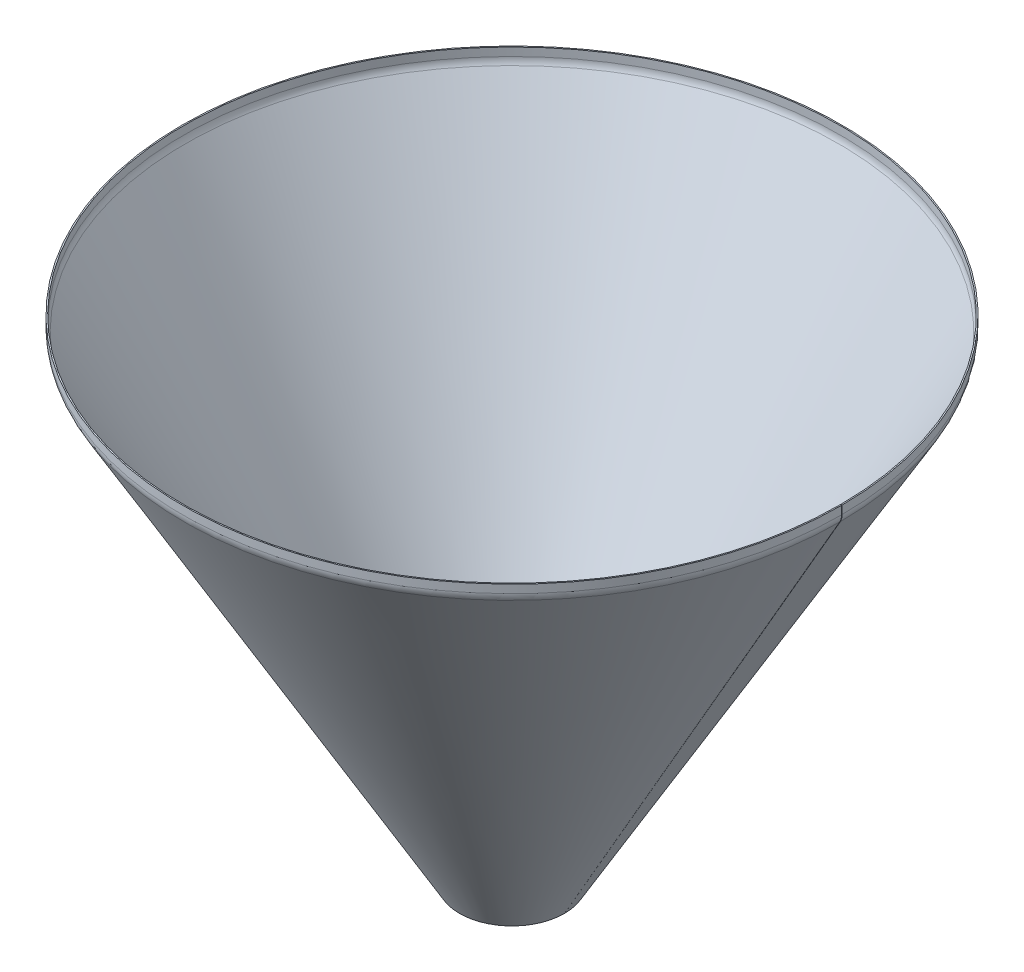
ISO-10303-21;
HEADER;
FILE_DESCRIPTION(('STEP AP214'),'2;1');
FILE_NAME('part.step','',(''),(''),'','','');
FILE_SCHEMA(('AUTOMOTIVE_DESIGN { 1 0 10303 214 1 1 1 1 }'));
ENDSEC;
DATA;
#1=APPLICATION_CONTEXT('core data for automotive mechanical design processes');
#2=APPLICATION_PROTOCOL_DEFINITION('international standard','automotive_design',2000,#1);
#3=PRODUCT_CONTEXT('',#1,'mechanical');
#4=PRODUCT('Part','Part','',(#3));
#5=PRODUCT_RELATED_PRODUCT_CATEGORY('part','',(#4));
#6=PRODUCT_DEFINITION_FORMATION('','',#4);
#7=PRODUCT_DEFINITION_CONTEXT('part definition',#1,'design');
#8=PRODUCT_DEFINITION('design','',#6,#7);
#9=PRODUCT_DEFINITION_SHAPE('','',#8);
#10=(LENGTH_UNIT() NAMED_UNIT(*) SI_UNIT(.MILLI.,.METRE.));
#11=(NAMED_UNIT(*) PLANE_ANGLE_UNIT() SI_UNIT($,.RADIAN.));
#12=(NAMED_UNIT(*) SI_UNIT($,.STERADIAN.) SOLID_ANGLE_UNIT());
#13=UNCERTAINTY_MEASURE_WITH_UNIT(LENGTH_MEASURE(1.E-05),#10,'distance_accuracy_value','');
#14=(GEOMETRIC_REPRESENTATION_CONTEXT(3) GLOBAL_UNCERTAINTY_ASSIGNED_CONTEXT((#13)) GLOBAL_UNIT_ASSIGNED_CONTEXT((#10,
#11,#12)) REPRESENTATION_CONTEXT('',''));
#15=CARTESIAN_POINT('',(0.,0.,0.));
#16=DIRECTION('',(0.,0.,1.));
#17=DIRECTION('',(1.,0.,0.));
#18=AXIS2_PLACEMENT_3D('',#15,#16,#17);
#19=CARTESIAN_POINT('',(-800.,-36.,0.));
#20=DIRECTION('',(0.,1.,0.));
#21=DIRECTION('',(0.,0.,1.));
#22=AXIS2_PLACEMENT_3D('',#19,#20,#21);
#23=CONICAL_SURFACE('',#22,792.712812921102,0.5235987755983);
#24=CARTESIAN_POINT('',(-800.,-36.,0.));
#25=DIRECTION('',(0.,1.,0.));
#26=DIRECTION('',(0.,0.,1.));
#27=AXIS2_PLACEMENT_3D('',#24,#25,#26);
#28=CIRCLE('',#27,792.712812921102);
#29=CARTESIAN_POINT('',(-7.28839444925004,-36.,-1.38354415839179));
#30=VERTEX_POINT('',#29);
#31=CARTESIAN_POINT('',(-7.28718707889801,-36.,0.));
#32=VERTEX_POINT('',#31);
#33=EDGE_CURVE('E11',#30,#32,#28,.T.);
#34=ORIENTED_EDGE('',*,*,#33,.T.);
#35=DIRECTION('',(-0.500000000000001,-0.866025403784438,0.));
#36=VECTOR('',#35,1.);
#37=CARTESIAN_POINT('',(-7.287187078898,-36.,0.));
#38=LINE('',#37,#36);
#39=CARTESIAN_POINT('',(-675.098076211353,-1192.68238982516,0.));
#40=VERTEX_POINT('',#39);
#41=EDGE_CURVE('E115',#32,#40,#38,.T.);
#42=ORIENTED_EDGE('',*,*,#41,.T.);
#43=CARTESIAN_POINT('',(-800.,-1192.68238982516,0.));
#44=DIRECTION('',(0.,1.,0.));
#45=DIRECTION('',(0.,0.,1.));
#46=AXIS2_PLACEMENT_3D('',#43,#44,#45);
#47=CIRCLE('',#46,124.901923788647);
#48=CARTESIAN_POINT('',(-675.098266447814,-1192.68238982516,-0.217994870541947));
#49=VERTEX_POINT('',#48);
#50=EDGE_CURVE('E97',#49,#40,#47,.T.);
#51=ORIENTED_EDGE('',*,*,#50,.F.);
#52=DIRECTION('',(-0.499999238456645,-0.866025403784438,0.000872664182942563));
#53=VECTOR('',#52,1.);
#54=CARTESIAN_POINT('',(-7.28839444925003,-36.,-1.38354415839179));
#55=LINE('',#54,#53);
#56=EDGE_CURVE('E135',#30,#49,#55,.T.);
#57=ORIENTED_EDGE('',*,*,#56,.F.);
#58=EDGE_LOOP('',(#34,#42,#51,#57));
#59=FACE_BOUND('',#58,.T.);
#60=ADVANCED_FACE('F33',(#59),#23,.F.);
#61=CARTESIAN_POINT('',(-800.,-20.,0.));
#62=DIRECTION('',(0.,1.,0.));
#63=DIRECTION('',(0.,0.,1.));
#64=AXIS2_PLACEMENT_3D('',#61,#62,#63);
#65=TOROIDAL_SURFACE('',#64,765.,32.);
#66=CARTESIAN_POINT('',(-800.,-20.,0.));
#67=DIRECTION('',(0.,1.,0.));
#68=DIRECTION('',(0.,0.,1.));
#69=AXIS2_PLACEMENT_3D('',#66,#67,#68);
#70=CIRCLE('',#69,797.);
#71=CARTESIAN_POINT('',(-3.00121390010973,-20.,-1.39102670761044));
#72=VERTEX_POINT('',#71);
#73=CARTESIAN_POINT('',(-3.00000000000002,-20.,0.));
#74=VERTEX_POINT('',#73);
#75=EDGE_CURVE('E41',#72,#74,#70,.T.);
#76=ORIENTED_EDGE('',*,*,#75,.T.);
#77=CARTESIAN_POINT('',(-35.,-20.,0.));
#78=DIRECTION('',(0.,0.,1.));
#79=DIRECTION('',(1.,0.,0.));
#80=AXIS2_PLACEMENT_3D('',#77,#78,#79);
#81=CIRCLE('',#80,32.);
#82=EDGE_CURVE('E133',#74,#32,#81,.F.);
#83=ORIENTED_EDGE('',*,*,#82,.T.);
#84=ORIENTED_EDGE('',*,*,#33,.F.);
#85=CARTESIAN_POINT('',(-35.0011651613349,-20.,-1.33517619990212));
#86=DIRECTION('',(0.00174532836588512,0.,0.999998476913288));
#87=DIRECTION('',(0.999998476913288,0.,-0.00174532836588512));
#88=AXIS2_PLACEMENT_3D('',#85,#86,#87);
#89=CIRCLE('',#88,32.);
#90=EDGE_CURVE('E109',#72,#30,#89,.F.);
#91=ORIENTED_EDGE('',*,*,#90,.F.);
#92=EDGE_LOOP('',(#76,#83,#84,#91));
#93=FACE_BOUND('',#92,.T.);
#94=ADVANCED_FACE('F35',(#93),#65,.F.);
#95=CARTESIAN_POINT('',(-800.,0.,0.));
#96=DIRECTION('',(0.,1.,0.));
#97=DIRECTION('',(0.,0.,1.));
#98=AXIS2_PLACEMENT_3D('',#95,#96,#97);
#99=CYLINDRICAL_SURFACE('',#98,797.);
#100=CARTESIAN_POINT('',(-800.,0.,0.));
#101=DIRECTION('',(0.,1.,0.));
#102=DIRECTION('',(0.,0.,1.));
#103=AXIS2_PLACEMENT_3D('',#100,#101,#102);
#104=CIRCLE('',#103,797.);
#105=CARTESIAN_POINT('',(-3.00121390010971,0.,-1.39102670761044));
#106=VERTEX_POINT('',#105);
#107=CARTESIAN_POINT('',(-3.,0.,0.));
#108=VERTEX_POINT('',#107);
#109=EDGE_CURVE('E160',#106,#108,#104,.T.);
#110=ORIENTED_EDGE('',*,*,#109,.T.);
#111=DIRECTION('',(0.,-1.,0.));
#112=VECTOR('',#111,1.);
#113=CARTESIAN_POINT('',(-3.,0.,0.));
#114=LINE('',#113,#112);
#115=EDGE_CURVE('E131',#108,#74,#114,.T.);
#116=ORIENTED_EDGE('',*,*,#115,.T.);
#117=ORIENTED_EDGE('',*,*,#75,.F.);
#118=DIRECTION('',(0.,-1.,0.));
#119=VECTOR('',#118,1.);
#120=CARTESIAN_POINT('',(-3.00121390010971,0.,-1.39102670761044));
#121=LINE('',#120,#119);
#122=EDGE_CURVE('E150',#106,#72,#121,.T.);
#123=ORIENTED_EDGE('',*,*,#122,.F.);
#124=EDGE_LOOP('',(#110,#116,#117,#123));
#125=FACE_BOUND('',#124,.T.);
#126=ADVANCED_FACE('F162',(#125),#99,.F.);
#127=CARTESIAN_POINT('',(-3.00121390010971,0.,-1.39102670761044));
#128=DIRECTION('',(0.,1.,0.));
#129=DIRECTION('',(0.,0.,1.));
#130=AXIS2_PLACEMENT_3D('',#127,#128,#129);
#131=PLANE('',#130);
#132=CARTESIAN_POINT('',(-800.,0.,0.));
#133=DIRECTION('',(0.,1.,0.));
#134=DIRECTION('',(0.,0.,1.));
#135=AXIS2_PLACEMENT_3D('',#132,#133,#134);
#136=CIRCLE('',#135,800.);
#137=CARTESIAN_POINT('',(-0.00121846936984582,0.,-1.3962626927081));
#138=VERTEX_POINT('',#137);
#139=CARTESIAN_POINT('',(0.,0.,0.));
#140=VERTEX_POINT('',#139);
#141=EDGE_CURVE('E158',#138,#140,#136,.T.);
#142=ORIENTED_EDGE('',*,*,#141,.T.);
#143=DIRECTION('',(1.,0.,0.));
#144=VECTOR('',#143,1.);
#145=CARTESIAN_POINT('',(-3.,0.,0.));
#146=LINE('',#145,#144);
#147=EDGE_CURVE('E128',#108,#140,#146,.T.);
#148=ORIENTED_EDGE('',*,*,#147,.F.);
#149=ORIENTED_EDGE('',*,*,#109,.F.);
#150=DIRECTION('',(0.999998476913288,0.,-0.00174532836588512));
#151=VECTOR('',#150,1.);
#152=CARTESIAN_POINT('',(-3.00121390010971,0.,-1.39102670761044));
#153=LINE('',#152,#151);
#154=EDGE_CURVE('E147',#106,#138,#153,.T.);
#155=ORIENTED_EDGE('',*,*,#154,.T.);
#156=EDGE_LOOP('',(#142,#148,#149,#155));
#157=FACE_BOUND('',#156,.T.);
#158=ADVANCED_FACE('F166',(#157),#131,.T.);
#159=CARTESIAN_POINT('',(-800.,0.,0.));
#160=DIRECTION('',(0.,1.,0.));
#161=DIRECTION('',(0.,0.,1.));
#162=AXIS2_PLACEMENT_3D('',#159,#160,#161);
#163=CYLINDRICAL_SURFACE('',#162,800.);
#164=CARTESIAN_POINT('',(-800.,-20.,0.));
#165=DIRECTION('',(0.,1.,0.));
#166=DIRECTION('',(0.,0.,1.));
#167=AXIS2_PLACEMENT_3D('',#164,#165,#166);
#168=CIRCLE('',#167,800.);
#169=CARTESIAN_POINT('',(-0.00121846936984337,-20.,-1.3962626927081));
#170=VERTEX_POINT('',#169);
#171=CARTESIAN_POINT('',(0.,-20.,0.));
#172=VERTEX_POINT('',#171);
#173=EDGE_CURVE('E156',#170,#172,#168,.T.);
#174=ORIENTED_EDGE('',*,*,#173,.T.);
#175=DIRECTION('',(0.,-1.,0.));
#176=VECTOR('',#175,1.);
#177=CARTESIAN_POINT('',(0.,0.,0.));
#178=LINE('',#177,#176);
#179=EDGE_CURVE('E125',#140,#172,#178,.T.);
#180=ORIENTED_EDGE('',*,*,#179,.F.);
#181=ORIENTED_EDGE('',*,*,#141,.F.);
#182=DIRECTION('',(0.,-1.,0.));
#183=VECTOR('',#182,1.);
#184=CARTESIAN_POINT('',(-0.00121846936984582,0.,-1.3962626927081));
#185=LINE('',#184,#183);
#186=EDGE_CURVE('E144',#138,#170,#185,.T.);
#187=ORIENTED_EDGE('',*,*,#186,.T.);
#188=EDGE_LOOP('',(#174,#180,#181,#187));
#189=FACE_BOUND('',#188,.T.);
#190=ADVANCED_FACE('F170',(#189),#163,.T.);
#191=CARTESIAN_POINT('',(-800.,-20.,0.));
#192=DIRECTION('',(0.,1.,0.));
#193=DIRECTION('',(0.,0.,1.));
#194=AXIS2_PLACEMENT_3D('',#191,#192,#193);
#195=TOROIDAL_SURFACE('',#194,765.,35.);
#196=CARTESIAN_POINT('',(-800.,-37.5,0.));
#197=DIRECTION('',(0.,1.,0.));
#198=DIRECTION('',(0.,0.,1.));
#199=AXIS2_PLACEMENT_3D('',#196,#197,#198);
#200=CIRCLE('',#199,795.310889132455);
#201=CARTESIAN_POINT('',(-4.69032219499208,-37.5,-1.38807865450019));
#202=VERTEX_POINT('',#201);
#203=CARTESIAN_POINT('',(-4.68911086754469,-37.5,0.));
#204=VERTEX_POINT('',#203);
#205=EDGE_CURVE('E154',#202,#204,#200,.T.);
#206=ORIENTED_EDGE('',*,*,#205,.T.);
#207=CARTESIAN_POINT('',(-35.,-20.,0.));
#208=DIRECTION('',(0.,0.,-1.));
#209=DIRECTION('',(1.,0.,0.));
#210=AXIS2_PLACEMENT_3D('',#207,#208,#209);
#211=CIRCLE('',#210,35.);
#212=EDGE_CURVE('E123',#172,#204,#211,.T.);
#213=ORIENTED_EDGE('',*,*,#212,.F.);
#214=ORIENTED_EDGE('',*,*,#173,.F.);
#215=CARTESIAN_POINT('',(-35.0011651613349,-20.,-1.33517619990212));
#216=DIRECTION('',(-0.00174532836588512,0.,-0.999998476913288));
#217=DIRECTION('',(0.999998476913288,0.,-0.00174532836588512));
#218=AXIS2_PLACEMENT_3D('',#215,#216,#217);
#219=CIRCLE('',#218,35.);
#220=EDGE_CURVE('E141',#170,#202,#219,.T.);
#221=ORIENTED_EDGE('',*,*,#220,.T.);
#222=EDGE_LOOP('',(#206,#213,#214,#221));
#223=FACE_BOUND('',#222,.T.);
#224=ADVANCED_FACE('F174',(#223),#195,.T.);
#225=CARTESIAN_POINT('',(-800.,-37.5,0.));
#226=DIRECTION('',(0.,1.,0.));
#227=DIRECTION('',(0.,0.,1.));
#228=AXIS2_PLACEMENT_3D('',#225,#226,#227);
#229=CONICAL_SURFACE('',#228,795.310889132455,0.5235987755983);
#230=CARTESIAN_POINT('',(-800.,-1194.18238982516,0.));
#231=DIRECTION('',(0.,1.,0.));
#232=DIRECTION('',(0.,0.,1.));
#233=AXIS2_PLACEMENT_3D('',#230,#231,#232);
#234=CIRCLE('',#233,127.5);
#235=CARTESIAN_POINT('',(-672.500194193556,-1194.18238982516,-0.222529366650353));
#236=VERTEX_POINT('',#235);
#237=CARTESIAN_POINT('',(-672.5,-1194.18238982516,0.));
#238=VERTEX_POINT('',#237);
#239=EDGE_CURVE('E108',#236,#238,#234,.T.);
#240=ORIENTED_EDGE('',*,*,#239,.T.);
#241=DIRECTION('',(-0.500000000000001,-0.866025403784438,0.));
#242=VECTOR('',#241,1.);
#243=CARTESIAN_POINT('',(-4.68911086754468,-37.5,0.));
#244=LINE('',#243,#242);
#245=EDGE_CURVE('E118',#204,#238,#244,.T.);
#246=ORIENTED_EDGE('',*,*,#245,.F.);
#247=ORIENTED_EDGE('',*,*,#205,.F.);
#248=DIRECTION('',(-0.499999238456645,-0.866025403784438,0.000872664182942563));
#249=VECTOR('',#248,1.);
#250=CARTESIAN_POINT('',(-4.69032219499207,-37.5,-1.38807865450019));
#251=LINE('',#250,#249);
#252=EDGE_CURVE('E138',#202,#236,#251,.T.);
#253=ORIENTED_EDGE('',*,*,#252,.T.);
#254=EDGE_LOOP('',(#240,#246,#247,#253));
#255=FACE_BOUND('',#254,.T.);
#256=ADVANCED_FACE('F177',(#255),#229,.T.);
#257=CARTESIAN_POINT('',(-800.,-1194.18238982516,0.));
#258=DIRECTION('',(0.,-1.,0.));
#259=DIRECTION('',(0.,0.,-1.));
#260=AXIS2_PLACEMENT_3D('',#257,#258,#259);
#261=CONICAL_SURFACE('',#260,127.5,1.04719755119665);
#262=DIRECTION('',(-0.866024084752678,0.499999999999957,0.00151149870280214));
#263=VECTOR('',#262,1.);
#264=CARTESIAN_POINT('',(-672.500194193556,-1194.18238982516,-0.222529366650353));
#265=LINE('',#264,#263);
#266=EDGE_CURVE('E103',#236,#49,#265,.T.);
#267=ORIENTED_EDGE('',*,*,#266,.T.);
#268=ORIENTED_EDGE('',*,*,#50,.T.);
#269=DIRECTION('',(-0.866025403784463,0.499999999999957,0.));
#270=VECTOR('',#269,1.);
#271=CARTESIAN_POINT('',(-672.5,-1194.18238982516,0.));
#272=LINE('',#271,#270);
#273=EDGE_CURVE('E100',#238,#40,#272,.T.);
#274=ORIENTED_EDGE('',*,*,#273,.F.);
#275=ORIENTED_EDGE('',*,*,#239,.F.);
#276=EDGE_LOOP('',(#267,#268,#274,#275));
#277=FACE_BOUND('',#276,.T.);
#278=ADVANCED_FACE('F99',(#277),#261,.F.);
#279=CARTESIAN_POINT('',(-35.0011651613349,-20.,-1.33517619990212));
#280=DIRECTION('',(-0.00174532836588512,0.,-0.999998476913288));
#281=DIRECTION('',(-0.999998476913288,0.,0.00174532836588512));
#282=AXIS2_PLACEMENT_3D('',#279,#280,#281);
#283=PLANE('',#282);
#284=ORIENTED_EDGE('',*,*,#56,.T.);
#285=ORIENTED_EDGE('',*,*,#266,.F.);
#286=ORIENTED_EDGE('',*,*,#252,.F.);
#287=ORIENTED_EDGE('',*,*,#220,.F.);
#288=ORIENTED_EDGE('',*,*,#186,.F.);
#289=ORIENTED_EDGE('',*,*,#154,.F.);
#290=ORIENTED_EDGE('',*,*,#122,.T.);
#291=ORIENTED_EDGE('',*,*,#90,.T.);
#292=EDGE_LOOP('',(#284,#285,#286,#287,#288,#289,#290,#291));
#293=FACE_BOUND('',#292,.T.);
#294=ADVANCED_FACE('F179',(#293),#283,.F.);
#295=CARTESIAN_POINT('',(-35.,-20.,0.));
#296=DIRECTION('',(0.,0.,-1.));
#297=DIRECTION('',(-1.,0.,0.));
#298=AXIS2_PLACEMENT_3D('',#295,#296,#297);
#299=PLANE('',#298);
#300=ORIENTED_EDGE('',*,*,#41,.F.);
#301=ORIENTED_EDGE('',*,*,#82,.F.);
#302=ORIENTED_EDGE('',*,*,#115,.F.);
#303=ORIENTED_EDGE('',*,*,#147,.T.);
#304=ORIENTED_EDGE('',*,*,#179,.T.);
#305=ORIENTED_EDGE('',*,*,#212,.T.);
#306=ORIENTED_EDGE('',*,*,#245,.T.);
#307=ORIENTED_EDGE('',*,*,#273,.T.);
#308=EDGE_LOOP('',(#300,#301,#302,#303,#304,#305,#306,#307));
#309=FACE_BOUND('',#308,.T.);
#310=ADVANCED_FACE('F113',(#309),#299,.T.);
#311=CLOSED_SHELL('',(#60,#94,#126,#158,#190,#224,#256,#278,#294,#310));
#312=MANIFOLD_SOLID_BREP('B2',#311);
#313=ADVANCED_BREP_SHAPE_REPRESENTATION('',(#18,#312),#14);
#314=SHAPE_DEFINITION_REPRESENTATION(#9,#313);
ENDSEC;
END-ISO-10303-21;
